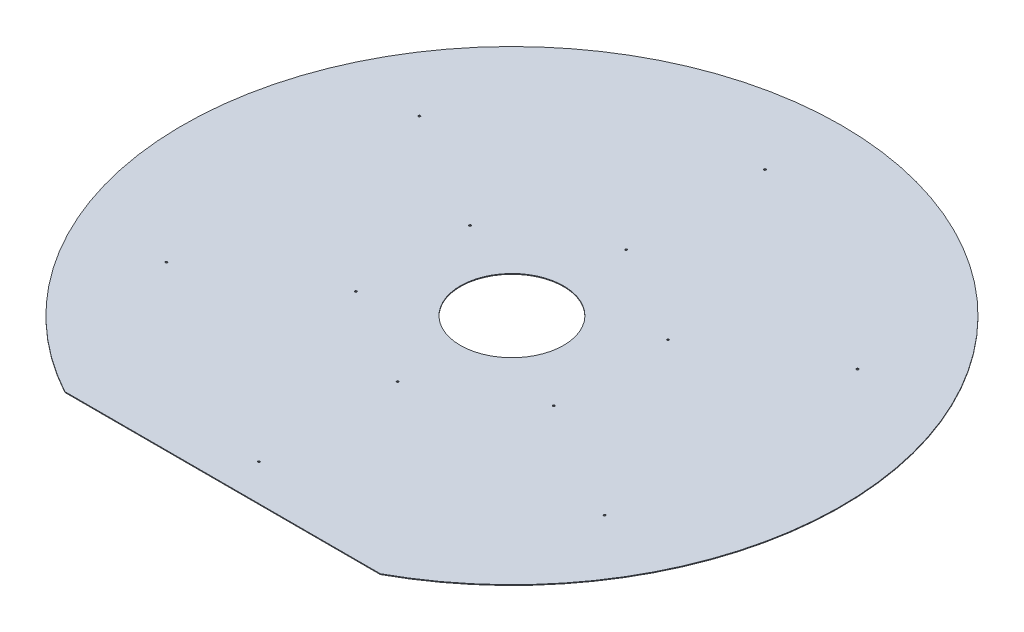
ISO-10303-21;
HEADER;
FILE_DESCRIPTION(('STEP AP214'),'2;1');
FILE_NAME('part.step','',(''),(''),'','','');
FILE_SCHEMA(('AUTOMOTIVE_DESIGN { 1 0 10303 214 1 1 1 1 }'));
ENDSEC;
DATA;
#1=APPLICATION_CONTEXT('core data for automotive mechanical design processes');
#2=APPLICATION_PROTOCOL_DEFINITION('international standard','automotive_design',2000,#1);
#3=PRODUCT_CONTEXT('',#1,'mechanical');
#4=PRODUCT('Part','Part','',(#3));
#5=PRODUCT_RELATED_PRODUCT_CATEGORY('part','',(#4));
#6=PRODUCT_DEFINITION_FORMATION('','',#4);
#7=PRODUCT_DEFINITION_CONTEXT('part definition',#1,'design');
#8=PRODUCT_DEFINITION('design','',#6,#7);
#9=PRODUCT_DEFINITION_SHAPE('','',#8);
#10=(LENGTH_UNIT() NAMED_UNIT(*) SI_UNIT(.MILLI.,.METRE.));
#11=(NAMED_UNIT(*) PLANE_ANGLE_UNIT() SI_UNIT($,.RADIAN.));
#12=(NAMED_UNIT(*) SI_UNIT($,.STERADIAN.) SOLID_ANGLE_UNIT());
#13=UNCERTAINTY_MEASURE_WITH_UNIT(LENGTH_MEASURE(1.E-05),#10,'distance_accuracy_value','');
#14=(GEOMETRIC_REPRESENTATION_CONTEXT(3) GLOBAL_UNCERTAINTY_ASSIGNED_CONTEXT((#13)) GLOBAL_UNIT_ASSIGNED_CONTEXT((#10,
#11,#12)) REPRESENTATION_CONTEXT('',''));
#15=CARTESIAN_POINT('',(0.,0.,0.));
#16=DIRECTION('',(0.,0.,1.));
#17=DIRECTION('',(1.,0.,0.));
#18=AXIS2_PLACEMENT_3D('',#15,#16,#17);
#19=CARTESIAN_POINT('',(0.,971.5,0.));
#20=DIRECTION('',(0.,1.,0.));
#21=DIRECTION('',(0.,0.,1.));
#22=AXIS2_PLACEMENT_3D('',#19,#20,#21);
#23=PLANE('',#22);
#24=CARTESIAN_POINT('',(0.,971.5,510.575));
#25=DIRECTION('',(0.,1.,0.));
#26=DIRECTION('',(0.,0.,1.));
#27=AXIS2_PLACEMENT_3D('',#24,#25,#26);
#28=CIRCLE('',#27,2.10000000000001);
#29=CARTESIAN_POINT('',(0.,971.5,512.675));
#30=VERTEX_POINT('',#29);
#31=EDGE_CURVE('E129',#30,#30,#28,.T.);
#32=ORIENTED_EDGE('',*,*,#31,.F.);
#33=EDGE_LOOP('',(#32));
#34=FACE_BOUND('',#33,.T.);
#35=CARTESIAN_POINT('',(199.683807477598,971.5,115.287499999998));
#36=DIRECTION('',(0.,1.,0.));
#37=DIRECTION('',(-0.866025403784443,0.,-0.499999999999992));
#38=AXIS2_PLACEMENT_3D('',#35,#36,#37);
#39=CIRCLE('',#38,2.1);
#40=CARTESIAN_POINT('',(197.865154129651,971.5,114.237499999998));
#41=VERTEX_POINT('',#40);
#42=EDGE_CURVE('E130',#41,#41,#39,.T.);
#43=ORIENTED_EDGE('',*,*,#42,.F.);
#44=EDGE_LOOP('',(#43));
#45=FACE_BOUND('',#44,.T.);
#46=CARTESIAN_POINT('',(442.170920537242,971.5,255.287499999996));
#47=DIRECTION('',(0.,1.,0.));
#48=DIRECTION('',(0.866025403784443,0.,0.499999999999992));
#49=AXIS2_PLACEMENT_3D('',#46,#47,#48);
#50=CIRCLE('',#49,2.10000000000001);
#51=CARTESIAN_POINT('',(443.989573885189,971.5,256.337499999996));
#52=VERTEX_POINT('',#51);
#53=EDGE_CURVE('E141',#52,#52,#50,.T.);
#54=ORIENTED_EDGE('',*,*,#53,.F.);
#55=EDGE_LOOP('',(#54));
#56=FACE_BOUND('',#55,.T.);
#57=CARTESIAN_POINT('',(199.683807477596,971.5,-115.287500000002));
#58=DIRECTION('',(0.,1.,0.));
#59=DIRECTION('',(-0.866025403784433,0.,0.50000000000001));
#60=AXIS2_PLACEMENT_3D('',#57,#58,#59);
#61=CIRCLE('',#60,2.1);
#62=CARTESIAN_POINT('',(197.865154129648,971.5,-114.237500000002));
#63=VERTEX_POINT('',#62);
#64=EDGE_CURVE('E142',#63,#63,#61,.T.);
#65=ORIENTED_EDGE('',*,*,#64,.F.);
#66=EDGE_LOOP('',(#65));
#67=FACE_BOUND('',#66,.T.);
#68=CARTESIAN_POINT('',(0.,971.5,230.575));
#69=DIRECTION('',(0.,1.,0.));
#70=DIRECTION('',(0.,0.,-1.));
#71=AXIS2_PLACEMENT_3D('',#68,#69,#70);
#72=CIRCLE('',#71,2.1);
#73=CARTESIAN_POINT('',(0.,971.5,228.475));
#74=VERTEX_POINT('',#73);
#75=EDGE_CURVE('E106',#74,#74,#72,.T.);
#76=ORIENTED_EDGE('',*,*,#75,.F.);
#77=EDGE_LOOP('',(#76));
#78=FACE_BOUND('',#77,.T.);
#79=CARTESIAN_POINT('',(-442.170920537239,971.5,255.287500000002));
#80=DIRECTION('',(0.,1.,0.));
#81=DIRECTION('',(-0.866025403784436,0.,0.500000000000004));
#82=AXIS2_PLACEMENT_3D('',#79,#80,#81);
#83=CIRCLE('',#82,2.10000000000001);
#84=CARTESIAN_POINT('',(-443.989573885186,971.5,256.337500000002));
#85=VERTEX_POINT('',#84);
#86=EDGE_CURVE('E105',#85,#85,#83,.T.);
#87=ORIENTED_EDGE('',*,*,#86,.F.);
#88=EDGE_LOOP('',(#87));
#89=FACE_BOUND('',#88,.T.);
#90=CARTESIAN_POINT('',(-199.683807477596,971.5,115.287500000001));
#91=DIRECTION('',(0.,1.,0.));
#92=DIRECTION('',(0.866025403784436,0.,-0.500000000000004));
#93=AXIS2_PLACEMENT_3D('',#90,#91,#92);
#94=CIRCLE('',#93,2.1);
#95=CARTESIAN_POINT('',(-197.865154129649,971.5,114.237500000001));
#96=VERTEX_POINT('',#95);
#97=EDGE_CURVE('E113',#96,#96,#94,.T.);
#98=ORIENTED_EDGE('',*,*,#97,.F.);
#99=EDGE_LOOP('',(#98));
#100=FACE_BOUND('',#99,.T.);
#101=CARTESIAN_POINT('',(-442.17092053724,971.5,-255.287499999999));
#102=DIRECTION('',(0.,1.,0.));
#103=DIRECTION('',(-0.86602540378444,0.,-0.499999999999998));
#104=AXIS2_PLACEMENT_3D('',#101,#102,#103);
#105=CIRCLE('',#104,2.10000000000001);
#106=CARTESIAN_POINT('',(-443.989573885188,971.5,-256.337499999999));
#107=VERTEX_POINT('',#106);
#108=EDGE_CURVE('E119',#107,#107,#105,.T.);
#109=ORIENTED_EDGE('',*,*,#108,.F.);
#110=EDGE_LOOP('',(#109));
#111=FACE_BOUND('',#110,.T.);
#112=CARTESIAN_POINT('',(442.170920537237,971.5,-255.287500000005));
#113=DIRECTION('',(0.,1.,0.));
#114=DIRECTION('',(0.866025403784433,0.,-0.50000000000001));
#115=AXIS2_PLACEMENT_3D('',#112,#113,#114);
#116=CIRCLE('',#115,2.10000000000001);
#117=CARTESIAN_POINT('',(443.989573885184,971.5,-256.337500000005));
#118=VERTEX_POINT('',#117);
#119=EDGE_CURVE('E152',#118,#118,#116,.T.);
#120=ORIENTED_EDGE('',*,*,#119,.F.);
#121=EDGE_LOOP('',(#120));
#122=FACE_BOUND('',#121,.T.);
#123=CARTESIAN_POINT('',(-199.683807477597,971.5,-115.2875));
#124=DIRECTION('',(0.,1.,0.));
#125=DIRECTION('',(0.86602540378444,0.,0.499999999999998));
#126=AXIS2_PLACEMENT_3D('',#123,#124,#125);
#127=CIRCLE('',#126,2.1);
#128=CARTESIAN_POINT('',(-197.86515412965,971.5,-114.2375));
#129=VERTEX_POINT('',#128);
#130=EDGE_CURVE('E98',#129,#129,#127,.T.);
#131=ORIENTED_EDGE('',*,*,#130,.F.);
#132=EDGE_LOOP('',(#131));
#133=FACE_BOUND('',#132,.T.);
#134=CARTESIAN_POINT('',(0.,971.5,-230.575));
#135=DIRECTION('',(0.,1.,0.));
#136=DIRECTION('',(0.,0.,1.));
#137=AXIS2_PLACEMENT_3D('',#134,#135,#136);
#138=CIRCLE('',#137,2.1);
#139=CARTESIAN_POINT('',(0.,971.5,-228.475));
#140=VERTEX_POINT('',#139);
#141=EDGE_CURVE('E87',#140,#140,#138,.T.);
#142=ORIENTED_EDGE('',*,*,#141,.F.);
#143=EDGE_LOOP('',(#142));
#144=FACE_BOUND('',#143,.T.);
#145=CARTESIAN_POINT('',(0.,971.5,-510.575));
#146=DIRECTION('',(0.,1.,0.));
#147=DIRECTION('',(0.,0.,-1.));
#148=AXIS2_PLACEMENT_3D('',#145,#146,#147);
#149=CIRCLE('',#148,2.10000000000001);
#150=CARTESIAN_POINT('',(0.,971.5,-512.675));
#151=VERTEX_POINT('',#150);
#152=EDGE_CURVE('E88',#151,#151,#149,.T.);
#153=ORIENTED_EDGE('',*,*,#152,.F.);
#154=EDGE_LOOP('',(#153));
#155=FACE_BOUND('',#154,.T.);
#156=CARTESIAN_POINT('',(0.,971.5,0.));
#157=DIRECTION('',(0.,1.,0.));
#158=DIRECTION('',(0.,0.,1.));
#159=AXIS2_PLACEMENT_3D('',#156,#157,#158);
#160=CIRCLE('',#159,665.);
#161=CARTESIAN_POINT('',(318.276802067116,971.5,583.88772659299));
#162=VERTEX_POINT('',#161);
#163=CARTESIAN_POINT('',(-318.276802067116,971.5,583.88772659299));
#164=VERTEX_POINT('',#163);
#165=EDGE_CURVE('E67',#162,#164,#160,.T.);
#166=ORIENTED_EDGE('',*,*,#165,.T.);
#167=DIRECTION('',(1.,0.,0.));
#168=VECTOR('',#167,1.);
#169=CARTESIAN_POINT('',(-318.276802067116,971.5,583.88772659299));
#170=LINE('',#169,#168);
#171=EDGE_CURVE('E52',#164,#162,#170,.T.);
#172=ORIENTED_EDGE('',*,*,#171,.T.);
#173=EDGE_LOOP('',(#166,#172));
#174=FACE_BOUND('',#173,.T.);
#175=CARTESIAN_POINT('',(0.,971.5,0.));
#176=DIRECTION('',(0.,1.,0.));
#177=DIRECTION('',(0.,0.,1.));
#178=AXIS2_PLACEMENT_3D('',#175,#176,#177);
#179=CIRCLE('',#178,104.15);
#180=CARTESIAN_POINT('',(0.,971.5,104.15));
#181=VERTEX_POINT('',#180);
#182=EDGE_CURVE('E73',#181,#181,#179,.T.);
#183=ORIENTED_EDGE('',*,*,#182,.F.);
#184=EDGE_LOOP('',(#183));
#185=FACE_BOUND('',#184,.T.);
#186=ADVANCED_FACE('F36',(#34,#45,#56,#67,#78,#89,#100,#111,#122,#133,#144,#155,#174,#185),#23,.T.);
#187=CARTESIAN_POINT('',(0.,970.,0.));
#188=DIRECTION('',(0.,1.,0.));
#189=DIRECTION('',(0.,0.,1.));
#190=AXIS2_PLACEMENT_3D('',#187,#188,#189);
#191=PLANE('',#190);
#192=CARTESIAN_POINT('',(0.,970.,510.575));
#193=DIRECTION('',(0.,1.,0.));
#194=DIRECTION('',(0.,0.,1.));
#195=AXIS2_PLACEMENT_3D('',#192,#193,#194);
#196=CIRCLE('',#195,2.10000000000001);
#197=CARTESIAN_POINT('',(0.,970.,512.675));
#198=VERTEX_POINT('',#197);
#199=EDGE_CURVE('E109',#198,#198,#196,.F.);
#200=ORIENTED_EDGE('',*,*,#199,.F.);
#201=EDGE_LOOP('',(#200));
#202=FACE_BOUND('',#201,.T.);
#203=CARTESIAN_POINT('',(199.683807477598,970.,115.287499999998));
#204=DIRECTION('',(0.,1.,0.));
#205=DIRECTION('',(0.,0.,1.));
#206=AXIS2_PLACEMENT_3D('',#203,#204,#205);
#207=CIRCLE('',#206,2.1);
#208=CARTESIAN_POINT('',(199.683807477598,970.,117.387499999998));
#209=VERTEX_POINT('',#208);
#210=EDGE_CURVE('E126',#209,#209,#207,.F.);
#211=ORIENTED_EDGE('',*,*,#210,.F.);
#212=EDGE_LOOP('',(#211));
#213=FACE_BOUND('',#212,.T.);
#214=CARTESIAN_POINT('',(442.170920537242,970.,255.287499999996));
#215=DIRECTION('',(0.,1.,0.));
#216=DIRECTION('',(0.,0.,1.));
#217=AXIS2_PLACEMENT_3D('',#214,#215,#216);
#218=CIRCLE('',#217,2.10000000000001);
#219=CARTESIAN_POINT('',(442.170920537242,970.,257.387499999996));
#220=VERTEX_POINT('',#219);
#221=EDGE_CURVE('E133',#220,#220,#218,.F.);
#222=ORIENTED_EDGE('',*,*,#221,.F.);
#223=EDGE_LOOP('',(#222));
#224=FACE_BOUND('',#223,.T.);
#225=CARTESIAN_POINT('',(199.683807477596,970.,-115.287500000002));
#226=DIRECTION('',(0.,1.,0.));
#227=DIRECTION('',(0.,0.,1.));
#228=AXIS2_PLACEMENT_3D('',#225,#226,#227);
#229=CIRCLE('',#228,2.1);
#230=CARTESIAN_POINT('',(199.683807477596,970.,-113.187500000002));
#231=VERTEX_POINT('',#230);
#232=EDGE_CURVE('E138',#231,#231,#229,.F.);
#233=ORIENTED_EDGE('',*,*,#232,.F.);
#234=EDGE_LOOP('',(#233));
#235=FACE_BOUND('',#234,.T.);
#236=CARTESIAN_POINT('',(0.,970.,230.575));
#237=DIRECTION('',(0.,1.,0.));
#238=DIRECTION('',(0.,0.,1.));
#239=AXIS2_PLACEMENT_3D('',#236,#237,#238);
#240=CIRCLE('',#239,2.1);
#241=CARTESIAN_POINT('',(0.,970.,232.675));
#242=VERTEX_POINT('',#241);
#243=EDGE_CURVE('E102',#242,#242,#240,.F.);
#244=ORIENTED_EDGE('',*,*,#243,.F.);
#245=EDGE_LOOP('',(#244));
#246=FACE_BOUND('',#245,.T.);
#247=CARTESIAN_POINT('',(-442.170920537239,970.,255.287500000002));
#248=DIRECTION('',(0.,1.,0.));
#249=DIRECTION('',(0.,0.,1.));
#250=AXIS2_PLACEMENT_3D('',#247,#248,#249);
#251=CIRCLE('',#250,2.10000000000001);
#252=CARTESIAN_POINT('',(-442.170920537239,970.,257.387500000002));
#253=VERTEX_POINT('',#252);
#254=EDGE_CURVE('E110',#253,#253,#251,.F.);
#255=ORIENTED_EDGE('',*,*,#254,.F.);
#256=EDGE_LOOP('',(#255));
#257=FACE_BOUND('',#256,.T.);
#258=CARTESIAN_POINT('',(-199.683807477596,970.,115.287500000001));
#259=DIRECTION('',(0.,1.,0.));
#260=DIRECTION('',(0.,0.,1.));
#261=AXIS2_PLACEMENT_3D('',#258,#259,#260);
#262=CIRCLE('',#261,2.1);
#263=CARTESIAN_POINT('',(-199.683807477596,970.,117.387500000001));
#264=VERTEX_POINT('',#263);
#265=EDGE_CURVE('E116',#264,#264,#262,.F.);
#266=ORIENTED_EDGE('',*,*,#265,.F.);
#267=EDGE_LOOP('',(#266));
#268=FACE_BOUND('',#267,.T.);
#269=CARTESIAN_POINT('',(-442.17092053724,970.,-255.287499999999));
#270=DIRECTION('',(0.,1.,0.));
#271=DIRECTION('',(0.,0.,1.));
#272=AXIS2_PLACEMENT_3D('',#269,#270,#271);
#273=CIRCLE('',#272,2.10000000000001);
#274=CARTESIAN_POINT('',(-442.17092053724,970.,-253.187499999999));
#275=VERTEX_POINT('',#274);
#276=EDGE_CURVE('E101',#275,#275,#273,.F.);
#277=ORIENTED_EDGE('',*,*,#276,.F.);
#278=EDGE_LOOP('',(#277));
#279=FACE_BOUND('',#278,.T.);
#280=CARTESIAN_POINT('',(442.170920537237,970.,-255.287500000005));
#281=DIRECTION('',(0.,1.,0.));
#282=DIRECTION('',(0.,0.,1.));
#283=AXIS2_PLACEMENT_3D('',#280,#281,#282);
#284=CIRCLE('',#283,2.10000000000001);
#285=CARTESIAN_POINT('',(442.170920537237,970.,-253.187500000005));
#286=VERTEX_POINT('',#285);
#287=EDGE_CURVE('E145',#286,#286,#284,.F.);
#288=ORIENTED_EDGE('',*,*,#287,.F.);
#289=EDGE_LOOP('',(#288));
#290=FACE_BOUND('',#289,.T.);
#291=CARTESIAN_POINT('',(-199.683807477597,970.,-115.2875));
#292=DIRECTION('',(0.,1.,0.));
#293=DIRECTION('',(0.,0.,1.));
#294=AXIS2_PLACEMENT_3D('',#291,#292,#293);
#295=CIRCLE('',#294,2.1);
#296=CARTESIAN_POINT('',(-199.683807477597,970.,-113.1875));
#297=VERTEX_POINT('',#296);
#298=EDGE_CURVE('E91',#297,#297,#295,.F.);
#299=ORIENTED_EDGE('',*,*,#298,.F.);
#300=EDGE_LOOP('',(#299));
#301=FACE_BOUND('',#300,.T.);
#302=CARTESIAN_POINT('',(0.,970.,-230.575));
#303=DIRECTION('',(0.,1.,0.));
#304=DIRECTION('',(0.,0.,1.));
#305=AXIS2_PLACEMENT_3D('',#302,#303,#304);
#306=CIRCLE('',#305,2.1);
#307=CARTESIAN_POINT('',(0.,970.,-228.475));
#308=VERTEX_POINT('',#307);
#309=EDGE_CURVE('E82',#308,#308,#306,.F.);
#310=ORIENTED_EDGE('',*,*,#309,.F.);
#311=EDGE_LOOP('',(#310));
#312=FACE_BOUND('',#311,.T.);
#313=CARTESIAN_POINT('',(0.,970.,-510.575));
#314=DIRECTION('',(0.,1.,0.));
#315=DIRECTION('',(0.,0.,1.));
#316=AXIS2_PLACEMENT_3D('',#313,#314,#315);
#317=CIRCLE('',#316,2.10000000000001);
#318=CARTESIAN_POINT('',(0.,970.,-508.475));
#319=VERTEX_POINT('',#318);
#320=EDGE_CURVE('E84',#319,#319,#317,.F.);
#321=ORIENTED_EDGE('',*,*,#320,.F.);
#322=EDGE_LOOP('',(#321));
#323=FACE_BOUND('',#322,.T.);
#324=CARTESIAN_POINT('',(0.,970.,0.));
#325=DIRECTION('',(0.,1.,0.));
#326=DIRECTION('',(0.,0.,1.));
#327=AXIS2_PLACEMENT_3D('',#324,#325,#326);
#328=CIRCLE('',#327,665.);
#329=CARTESIAN_POINT('',(318.276802067116,970.,583.88772659299));
#330=VERTEX_POINT('',#329);
#331=CARTESIAN_POINT('',(-318.276802067116,970.,583.88772659299));
#332=VERTEX_POINT('',#331);
#333=EDGE_CURVE('E68',#330,#332,#328,.T.);
#334=ORIENTED_EDGE('',*,*,#333,.F.);
#335=DIRECTION('',(1.,0.,0.));
#336=VECTOR('',#335,1.);
#337=CARTESIAN_POINT('',(-318.276802067116,970.,583.88772659299));
#338=LINE('',#337,#336);
#339=EDGE_CURVE('E60',#332,#330,#338,.T.);
#340=ORIENTED_EDGE('',*,*,#339,.F.);
#341=EDGE_LOOP('',(#334,#340));
#342=FACE_BOUND('',#341,.T.);
#343=CARTESIAN_POINT('',(0.,970.,0.));
#344=DIRECTION('',(0.,1.,0.));
#345=DIRECTION('',(0.,0.,1.));
#346=AXIS2_PLACEMENT_3D('',#343,#344,#345);
#347=CIRCLE('',#346,104.15);
#348=CARTESIAN_POINT('',(0.,970.,104.15));
#349=VERTEX_POINT('',#348);
#350=EDGE_CURVE('E76',#349,#349,#347,.T.);
#351=ORIENTED_EDGE('',*,*,#350,.T.);
#352=EDGE_LOOP('',(#351));
#353=FACE_BOUND('',#352,.T.);
#354=ADVANCED_FACE('F71',(#202,#213,#224,#235,#246,#257,#268,#279,#290,#301,#312,#323,#342,
#353),#191,.F.);
#355=CARTESIAN_POINT('',(0.,971.5,0.));
#356=DIRECTION('',(0.,-1.,0.));
#357=DIRECTION('',(0.,0.,-1.));
#358=AXIS2_PLACEMENT_3D('',#355,#356,#357);
#359=CYLINDRICAL_SURFACE('',#358,665.);
#360=ORIENTED_EDGE('',*,*,#333,.T.);
#361=DIRECTION('',(0.,-1.,0.));
#362=VECTOR('',#361,1.);
#363=CARTESIAN_POINT('',(-318.276802067116,971.5,583.88772659299));
#364=LINE('',#363,#362);
#365=EDGE_CURVE('E11',#164,#332,#364,.T.);
#366=ORIENTED_EDGE('',*,*,#365,.F.);
#367=ORIENTED_EDGE('',*,*,#165,.F.);
#368=DIRECTION('',(0.,-1.,0.));
#369=VECTOR('',#368,1.);
#370=CARTESIAN_POINT('',(318.276802067116,971.5,583.88772659299));
#371=LINE('',#370,#369);
#372=EDGE_CURVE('E45',#162,#330,#371,.T.);
#373=ORIENTED_EDGE('',*,*,#372,.T.);
#374=EDGE_LOOP('',(#360,#366,#367,#373));
#375=FACE_BOUND('',#374,.T.);
#376=ADVANCED_FACE('F38',(#375),#359,.T.);
#377=CARTESIAN_POINT('',(-318.276802067116,971.5,583.88772659299));
#378=DIRECTION('',(0.,0.,-1.));
#379=DIRECTION('',(-1.,0.,0.));
#380=AXIS2_PLACEMENT_3D('',#377,#378,#379);
#381=PLANE('',#380);
#382=ORIENTED_EDGE('',*,*,#339,.T.);
#383=ORIENTED_EDGE('',*,*,#372,.F.);
#384=ORIENTED_EDGE('',*,*,#171,.F.);
#385=ORIENTED_EDGE('',*,*,#365,.T.);
#386=EDGE_LOOP('',(#382,#383,#384,#385));
#387=FACE_BOUND('',#386,.T.);
#388=ADVANCED_FACE('F63',(#387),#381,.F.);
#389=CARTESIAN_POINT('',(0.,971.5,0.));
#390=DIRECTION('',(0.,-1.,0.));
#391=DIRECTION('',(0.,0.,-1.));
#392=AXIS2_PLACEMENT_3D('',#389,#390,#391);
#393=CYLINDRICAL_SURFACE('',#392,104.15);
#394=ORIENTED_EDGE('',*,*,#182,.T.);
#395=EDGE_LOOP('',(#394));
#396=FACE_BOUND('',#395,.T.);
#397=ORIENTED_EDGE('',*,*,#350,.F.);
#398=EDGE_LOOP('',(#397));
#399=FACE_BOUND('',#398,.T.);
#400=ADVANCED_FACE('F171',(#396,#399),#393,.F.);
#401=CARTESIAN_POINT('',(0.,-36.0010000000001,-510.575));
#402=DIRECTION('',(0.,1.,0.));
#403=DIRECTION('',(0.,0.,1.));
#404=AXIS2_PLACEMENT_3D('',#401,#402,#403);
#405=CYLINDRICAL_SURFACE('',#404,2.10000000000001);
#406=ORIENTED_EDGE('',*,*,#152,.T.);
#407=EDGE_LOOP('',(#406));
#408=FACE_BOUND('',#407,.T.);
#409=ORIENTED_EDGE('',*,*,#320,.T.);
#410=EDGE_LOOP('',(#409));
#411=FACE_BOUND('',#410,.T.);
#412=ADVANCED_FACE('F174',(#408,#411),#405,.F.);
#413=CARTESIAN_POINT('',(0.,-36.0010000000001,-230.575));
#414=DIRECTION('',(0.,1.,0.));
#415=DIRECTION('',(0.,0.,1.));
#416=AXIS2_PLACEMENT_3D('',#413,#414,#415);
#417=CYLINDRICAL_SURFACE('',#416,2.1);
#418=ORIENTED_EDGE('',*,*,#141,.T.);
#419=EDGE_LOOP('',(#418));
#420=FACE_BOUND('',#419,.T.);
#421=ORIENTED_EDGE('',*,*,#309,.T.);
#422=EDGE_LOOP('',(#421));
#423=FACE_BOUND('',#422,.T.);
#424=ADVANCED_FACE('F202',(#420,#423),#417,.F.);
#425=CARTESIAN_POINT('',(-199.683807477597,969.999,-115.2875));
#426=DIRECTION('',(0.,1.,0.));
#427=DIRECTION('',(0.,0.,1.));
#428=AXIS2_PLACEMENT_3D('',#425,#426,#427);
#429=CYLINDRICAL_SURFACE('',#428,2.1);
#430=ORIENTED_EDGE('',*,*,#130,.T.);
#431=EDGE_LOOP('',(#430));
#432=FACE_BOUND('',#431,.T.);
#433=ORIENTED_EDGE('',*,*,#298,.T.);
#434=EDGE_LOOP('',(#433));
#435=FACE_BOUND('',#434,.T.);
#436=ADVANCED_FACE('F211',(#432,#435),#429,.F.);
#437=CARTESIAN_POINT('',(442.170920537237,969.999,-255.287500000005));
#438=DIRECTION('',(0.,1.,0.));
#439=DIRECTION('',(0.,0.,1.));
#440=AXIS2_PLACEMENT_3D('',#437,#438,#439);
#441=CYLINDRICAL_SURFACE('',#440,2.10000000000001);
#442=ORIENTED_EDGE('',*,*,#119,.T.);
#443=EDGE_LOOP('',(#442));
#444=FACE_BOUND('',#443,.T.);
#445=ORIENTED_EDGE('',*,*,#287,.T.);
#446=EDGE_LOOP('',(#445));
#447=FACE_BOUND('',#446,.T.);
#448=ADVANCED_FACE('F156',(#444,#447),#441,.F.);
#449=CARTESIAN_POINT('',(-442.17092053724,969.999,-255.287499999999));
#450=DIRECTION('',(0.,1.,0.));
#451=DIRECTION('',(0.,0.,1.));
#452=AXIS2_PLACEMENT_3D('',#449,#450,#451);
#453=CYLINDRICAL_SURFACE('',#452,2.10000000000001);
#454=ORIENTED_EDGE('',*,*,#108,.T.);
#455=EDGE_LOOP('',(#454));
#456=FACE_BOUND('',#455,.T.);
#457=ORIENTED_EDGE('',*,*,#276,.T.);
#458=EDGE_LOOP('',(#457));
#459=FACE_BOUND('',#458,.T.);
#460=ADVANCED_FACE('F228',(#456,#459),#453,.F.);
#461=CARTESIAN_POINT('',(-199.683807477596,969.999,115.287500000001));
#462=DIRECTION('',(0.,1.,0.));
#463=DIRECTION('',(0.,0.,1.));
#464=AXIS2_PLACEMENT_3D('',#461,#462,#463);
#465=CYLINDRICAL_SURFACE('',#464,2.1);
#466=ORIENTED_EDGE('',*,*,#97,.T.);
#467=EDGE_LOOP('',(#466));
#468=FACE_BOUND('',#467,.T.);
#469=ORIENTED_EDGE('',*,*,#265,.T.);
#470=EDGE_LOOP('',(#469));
#471=FACE_BOUND('',#470,.T.);
#472=ADVANCED_FACE('F236',(#468,#471),#465,.F.);
#473=CARTESIAN_POINT('',(-442.170920537239,969.999,255.287500000002));
#474=DIRECTION('',(0.,1.,0.));
#475=DIRECTION('',(0.,0.,1.));
#476=AXIS2_PLACEMENT_3D('',#473,#474,#475);
#477=CYLINDRICAL_SURFACE('',#476,2.10000000000001);
#478=ORIENTED_EDGE('',*,*,#86,.T.);
#479=EDGE_LOOP('',(#478));
#480=FACE_BOUND('',#479,.T.);
#481=ORIENTED_EDGE('',*,*,#254,.T.);
#482=EDGE_LOOP('',(#481));
#483=FACE_BOUND('',#482,.T.);
#484=ADVANCED_FACE('F245',(#480,#483),#477,.F.);
#485=CARTESIAN_POINT('',(0.,969.999,230.575));
#486=DIRECTION('',(0.,1.,0.));
#487=DIRECTION('',(0.,0.,1.));
#488=AXIS2_PLACEMENT_3D('',#485,#486,#487);
#489=CYLINDRICAL_SURFACE('',#488,2.1);
#490=ORIENTED_EDGE('',*,*,#75,.T.);
#491=EDGE_LOOP('',(#490));
#492=FACE_BOUND('',#491,.T.);
#493=ORIENTED_EDGE('',*,*,#243,.T.);
#494=EDGE_LOOP('',(#493));
#495=FACE_BOUND('',#494,.T.);
#496=ADVANCED_FACE('F254',(#492,#495),#489,.F.);
#497=CARTESIAN_POINT('',(199.683807477596,969.999,-115.287500000002));
#498=DIRECTION('',(0.,1.,0.));
#499=DIRECTION('',(0.,0.,1.));
#500=AXIS2_PLACEMENT_3D('',#497,#498,#499);
#501=CYLINDRICAL_SURFACE('',#500,2.1);
#502=ORIENTED_EDGE('',*,*,#64,.T.);
#503=EDGE_LOOP('',(#502));
#504=FACE_BOUND('',#503,.T.);
#505=ORIENTED_EDGE('',*,*,#232,.T.);
#506=EDGE_LOOP('',(#505));
#507=FACE_BOUND('',#506,.T.);
#508=ADVANCED_FACE('F263',(#504,#507),#501,.F.);
#509=CARTESIAN_POINT('',(442.170920537242,969.999,255.287499999996));
#510=DIRECTION('',(0.,1.,0.));
#511=DIRECTION('',(0.,0.,1.));
#512=AXIS2_PLACEMENT_3D('',#509,#510,#511);
#513=CYLINDRICAL_SURFACE('',#512,2.10000000000001);
#514=ORIENTED_EDGE('',*,*,#53,.T.);
#515=EDGE_LOOP('',(#514));
#516=FACE_BOUND('',#515,.T.);
#517=ORIENTED_EDGE('',*,*,#221,.T.);
#518=EDGE_LOOP('',(#517));
#519=FACE_BOUND('',#518,.T.);
#520=ADVANCED_FACE('F272',(#516,#519),#513,.F.);
#521=CARTESIAN_POINT('',(199.683807477598,969.999,115.287499999998));
#522=DIRECTION('',(0.,1.,0.));
#523=DIRECTION('',(0.,0.,1.));
#524=AXIS2_PLACEMENT_3D('',#521,#522,#523);
#525=CYLINDRICAL_SURFACE('',#524,2.1);
#526=ORIENTED_EDGE('',*,*,#42,.T.);
#527=EDGE_LOOP('',(#526));
#528=FACE_BOUND('',#527,.T.);
#529=ORIENTED_EDGE('',*,*,#210,.T.);
#530=EDGE_LOOP('',(#529));
#531=FACE_BOUND('',#530,.T.);
#532=ADVANCED_FACE('F281',(#528,#531),#525,.F.);
#533=CARTESIAN_POINT('',(0.,969.999,510.575));
#534=DIRECTION('',(0.,1.,0.));
#535=DIRECTION('',(0.,0.,1.));
#536=AXIS2_PLACEMENT_3D('',#533,#534,#535);
#537=CYLINDRICAL_SURFACE('',#536,2.10000000000001);
#538=ORIENTED_EDGE('',*,*,#31,.T.);
#539=EDGE_LOOP('',(#538));
#540=FACE_BOUND('',#539,.T.);
#541=ORIENTED_EDGE('',*,*,#199,.T.);
#542=EDGE_LOOP('',(#541));
#543=FACE_BOUND('',#542,.T.);
#544=ADVANCED_FACE('F290',(#540,#543),#537,.F.);
#545=CLOSED_SHELL('',(#186,#354,#376,#388,#400,#412,#424,#436,#448,#460,#472,#484,#496,#508,
#520,#532,#544));
#546=MANIFOLD_SOLID_BREP('B2',#545);
#547=ADVANCED_BREP_SHAPE_REPRESENTATION('',(#18,#546),#14);
#548=SHAPE_DEFINITION_REPRESENTATION(#9,#547);
ENDSEC;
END-ISO-10303-21;
